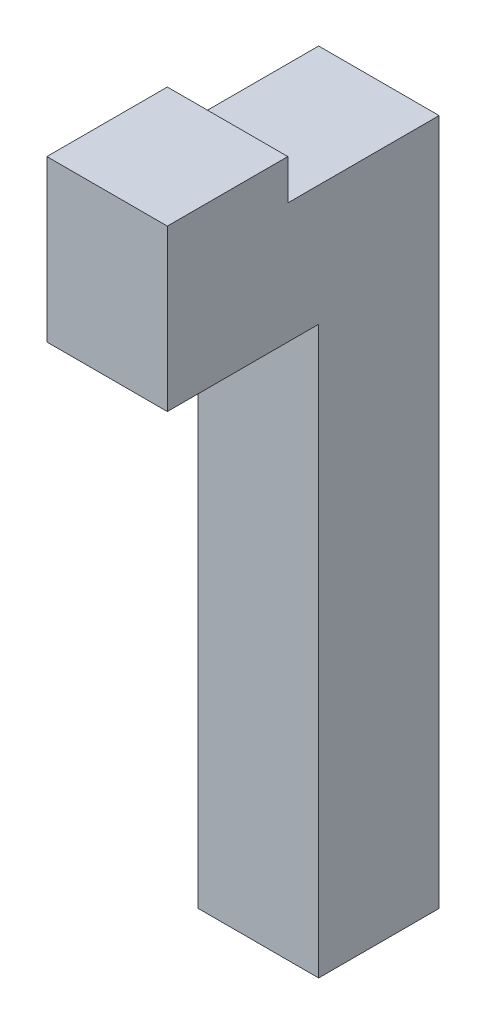
ISO-10303-21;
HEADER;
FILE_DESCRIPTION(('STEP AP214'),'2;1');
FILE_NAME('part.step','',(''),(''),'','','');
FILE_SCHEMA(('AUTOMOTIVE_DESIGN { 1 0 10303 214 1 1 1 1 }'));
ENDSEC;
DATA;
#1=APPLICATION_CONTEXT('core data for automotive mechanical design processes');
#2=APPLICATION_PROTOCOL_DEFINITION('international standard','automotive_design',2000,#1);
#3=PRODUCT_CONTEXT('',#1,'mechanical');
#4=PRODUCT('Part','Part','',(#3));
#5=PRODUCT_RELATED_PRODUCT_CATEGORY('part','',(#4));
#6=PRODUCT_DEFINITION_FORMATION('','',#4);
#7=PRODUCT_DEFINITION_CONTEXT('part definition',#1,'design');
#8=PRODUCT_DEFINITION('design','',#6,#7);
#9=PRODUCT_DEFINITION_SHAPE('','',#8);
#10=(LENGTH_UNIT() NAMED_UNIT(*) SI_UNIT(.MILLI.,.METRE.));
#11=(NAMED_UNIT(*) PLANE_ANGLE_UNIT() SI_UNIT($,.RADIAN.));
#12=(NAMED_UNIT(*) SI_UNIT($,.STERADIAN.) SOLID_ANGLE_UNIT());
#13=UNCERTAINTY_MEASURE_WITH_UNIT(LENGTH_MEASURE(1.E-05),#10,'distance_accuracy_value','');
#14=(GEOMETRIC_REPRESENTATION_CONTEXT(3) GLOBAL_UNCERTAINTY_ASSIGNED_CONTEXT((#13)) GLOBAL_UNIT_ASSIGNED_CONTEXT((#10,
#11,#12)) REPRESENTATION_CONTEXT('',''));
#15=CARTESIAN_POINT('',(0.,0.,0.));
#16=DIRECTION('',(0.,0.,1.));
#17=DIRECTION('',(1.,0.,0.));
#18=AXIS2_PLACEMENT_3D('',#15,#16,#17);
#19=CARTESIAN_POINT('',(-15.,171.,15.));
#20=DIRECTION('',(0.,0.,-1.));
#21=DIRECTION('',(-1.,0.,0.));
#22=AXIS2_PLACEMENT_3D('',#19,#20,#21);
#23=PLANE('',#22);
#24=DIRECTION('',(1.,0.,0.));
#25=VECTOR('',#24,1.);
#26=CARTESIAN_POINT('',(-15.,141.,15.));
#27=LINE('',#26,#25);
#28=CARTESIAN_POINT('',(-15.,141.,15.));
#29=VERTEX_POINT('',#28);
#30=CARTESIAN_POINT('',(15.,141.,15.));
#31=VERTEX_POINT('',#30);
#32=EDGE_CURVE('E62',#29,#31,#27,.T.);
#33=ORIENTED_EDGE('',*,*,#32,.F.);
#34=DIRECTION('',(0.,-1.,0.));
#35=VECTOR('',#34,1.);
#36=CARTESIAN_POINT('',(-15.,171.,15.));
#37=LINE('',#36,#35);
#38=CARTESIAN_POINT('',(-15.,0.,15.));
#39=VERTEX_POINT('',#38);
#40=EDGE_CURVE('E171',#29,#39,#37,.T.);
#41=ORIENTED_EDGE('',*,*,#40,.T.);
#42=DIRECTION('',(1.,0.,0.));
#43=VECTOR('',#42,1.);
#44=CARTESIAN_POINT('',(-15.,0.,15.));
#45=LINE('',#44,#43);
#46=CARTESIAN_POINT('',(15.,0.,15.));
#47=VERTEX_POINT('',#46);
#48=EDGE_CURVE('E157',#39,#47,#45,.T.);
#49=ORIENTED_EDGE('',*,*,#48,.T.);
#50=DIRECTION('',(0.,-1.,0.));
#51=VECTOR('',#50,1.);
#52=CARTESIAN_POINT('',(15.,171.,15.));
#53=LINE('',#52,#51);
#54=EDGE_CURVE('E161',#31,#47,#53,.T.);
#55=ORIENTED_EDGE('',*,*,#54,.F.);
#56=EDGE_LOOP('',(#33,#41,#49,#55));
#57=FACE_BOUND('',#56,.T.);
#58=ADVANCED_FACE('F39',(#57),#23,.F.);
#59=CARTESIAN_POINT('',(15.,171.,-15.));
#60=DIRECTION('',(-1.,0.,0.));
#61=DIRECTION('',(0.,0.,1.));
#62=AXIS2_PLACEMENT_3D('',#59,#60,#61);
#63=PLANE('',#62);
#64=DIRECTION('',(0.,0.,-1.));
#65=VECTOR('',#64,1.);
#66=CARTESIAN_POINT('',(15.,0.,-15.));
#67=LINE('',#66,#65);
#68=CARTESIAN_POINT('',(15.,0.,-15.));
#69=VERTEX_POINT('',#68);
#70=EDGE_CURVE('E151',#47,#69,#67,.T.);
#71=ORIENTED_EDGE('',*,*,#70,.T.);
#72=DIRECTION('',(0.,-1.,0.));
#73=VECTOR('',#72,1.);
#74=CARTESIAN_POINT('',(15.,171.,-15.));
#75=LINE('',#74,#73);
#76=CARTESIAN_POINT('',(15.,171.,-15.));
#77=VERTEX_POINT('',#76);
#78=EDGE_CURVE('E11',#77,#69,#75,.T.);
#79=ORIENTED_EDGE('',*,*,#78,.F.);
#80=DIRECTION('',(0.,0.,-1.));
#81=VECTOR('',#80,1.);
#82=CARTESIAN_POINT('',(15.,171.,-15.));
#83=LINE('',#82,#81);
#84=CARTESIAN_POINT('',(15.,171.,22.6839));
#85=VERTEX_POINT('',#84);
#86=EDGE_CURVE('E154',#85,#77,#83,.T.);
#87=ORIENTED_EDGE('',*,*,#86,.F.);
#88=DIRECTION('',(0.,-1.,0.));
#89=VECTOR('',#88,1.);
#90=CARTESIAN_POINT('',(15.,181.,22.6839));
#91=LINE('',#90,#89);
#92=CARTESIAN_POINT('',(15.,181.,22.6839));
#93=VERTEX_POINT('',#92);
#94=EDGE_CURVE('E137',#93,#85,#91,.T.);
#95=ORIENTED_EDGE('',*,*,#94,.F.);
#96=DIRECTION('',(0.,0.,-1.));
#97=VECTOR('',#96,1.);
#98=CARTESIAN_POINT('',(15.,181.,52.6839));
#99=LINE('',#98,#97);
#100=CARTESIAN_POINT('',(15.,181.,52.6839));
#101=VERTEX_POINT('',#100);
#102=EDGE_CURVE('E124',#101,#93,#99,.T.);
#103=ORIENTED_EDGE('',*,*,#102,.F.);
#104=DIRECTION('',(0.,1.,0.));
#105=VECTOR('',#104,1.);
#106=CARTESIAN_POINT('',(15.,171.,52.6839));
#107=LINE('',#106,#105);
#108=CARTESIAN_POINT('',(15.,141.,52.6839));
#109=VERTEX_POINT('',#108);
#110=EDGE_CURVE('E121',#109,#101,#107,.T.);
#111=ORIENTED_EDGE('',*,*,#110,.F.);
#112=DIRECTION('',(0.,0.,-1.));
#113=VECTOR('',#112,1.);
#114=CARTESIAN_POINT('',(15.,141.,52.6839));
#115=LINE('',#114,#113);
#116=EDGE_CURVE('E142',#109,#31,#115,.T.);
#117=ORIENTED_EDGE('',*,*,#116,.T.);
#118=ORIENTED_EDGE('',*,*,#54,.T.);
#119=EDGE_LOOP('',(#71,#79,#87,#95,#103,#111,#117,#118));
#120=FACE_BOUND('',#119,.T.);
#121=ADVANCED_FACE('F41',(#120),#63,.F.);
#122=CARTESIAN_POINT('',(-15.,171.,-15.));
#123=DIRECTION('',(0.,0.,1.));
#124=DIRECTION('',(1.,0.,0.));
#125=AXIS2_PLACEMENT_3D('',#122,#123,#124);
#126=PLANE('',#125);
#127=DIRECTION('',(-1.,0.,0.));
#128=VECTOR('',#127,1.);
#129=CARTESIAN_POINT('',(-15.,0.,-15.));
#130=LINE('',#129,#128);
#131=CARTESIAN_POINT('',(-15.,0.,-15.));
#132=VERTEX_POINT('',#131);
#133=EDGE_CURVE('E164',#69,#132,#130,.T.);
#134=ORIENTED_EDGE('',*,*,#133,.T.);
#135=DIRECTION('',(0.,-1.,0.));
#136=VECTOR('',#135,1.);
#137=CARTESIAN_POINT('',(-15.,171.,-15.));
#138=LINE('',#137,#136);
#139=CARTESIAN_POINT('',(-15.,171.,-15.));
#140=VERTEX_POINT('',#139);
#141=EDGE_CURVE('E47',#140,#132,#138,.T.);
#142=ORIENTED_EDGE('',*,*,#141,.F.);
#143=DIRECTION('',(-1.,0.,0.));
#144=VECTOR('',#143,1.);
#145=CARTESIAN_POINT('',(-15.,171.,-15.));
#146=LINE('',#145,#144);
#147=EDGE_CURVE('E156',#77,#140,#146,.T.);
#148=ORIENTED_EDGE('',*,*,#147,.F.);
#149=ORIENTED_EDGE('',*,*,#78,.T.);
#150=EDGE_LOOP('',(#134,#142,#148,#149));
#151=FACE_BOUND('',#150,.T.);
#152=ADVANCED_FACE('F205',(#151),#126,.F.);
#153=CARTESIAN_POINT('',(-15.,171.,-15.));
#154=DIRECTION('',(1.,0.,0.));
#155=DIRECTION('',(0.,0.,-1.));
#156=AXIS2_PLACEMENT_3D('',#153,#154,#155);
#157=PLANE('',#156);
#158=DIRECTION('',(0.,0.,1.));
#159=VECTOR('',#158,1.);
#160=CARTESIAN_POINT('',(-15.,0.,-15.));
#161=LINE('',#160,#159);
#162=EDGE_CURVE('E166',#132,#39,#161,.T.);
#163=ORIENTED_EDGE('',*,*,#162,.T.);
#164=ORIENTED_EDGE('',*,*,#40,.F.);
#165=DIRECTION('',(0.,0.,-1.));
#166=VECTOR('',#165,1.);
#167=CARTESIAN_POINT('',(-15.,141.,52.6839));
#168=LINE('',#167,#166);
#169=CARTESIAN_POINT('',(-15.,141.,52.6839));
#170=VERTEX_POINT('',#169);
#171=EDGE_CURVE('E113',#170,#29,#168,.T.);
#172=ORIENTED_EDGE('',*,*,#171,.F.);
#173=DIRECTION('',(0.,-1.,0.));
#174=VECTOR('',#173,1.);
#175=CARTESIAN_POINT('',(-15.,171.,52.6839));
#176=LINE('',#175,#174);
#177=CARTESIAN_POINT('',(-15.,181.,52.6839));
#178=VERTEX_POINT('',#177);
#179=EDGE_CURVE('E105',#178,#170,#176,.T.);
#180=ORIENTED_EDGE('',*,*,#179,.F.);
#181=DIRECTION('',(0.,0.,1.));
#182=VECTOR('',#181,1.);
#183=CARTESIAN_POINT('',(-15.,181.,52.6839));
#184=LINE('',#183,#182);
#185=CARTESIAN_POINT('',(-15.,181.,22.6839));
#186=VERTEX_POINT('',#185);
#187=EDGE_CURVE('E111',#186,#178,#184,.T.);
#188=ORIENTED_EDGE('',*,*,#187,.F.);
#189=DIRECTION('',(0.,-1.,0.));
#190=VECTOR('',#189,1.);
#191=CARTESIAN_POINT('',(-15.,181.,22.6839));
#192=LINE('',#191,#190);
#193=CARTESIAN_POINT('',(-15.,171.,22.6839));
#194=VERTEX_POINT('',#193);
#195=EDGE_CURVE('E134',#186,#194,#192,.T.);
#196=ORIENTED_EDGE('',*,*,#195,.T.);
#197=DIRECTION('',(0.,0.,1.));
#198=VECTOR('',#197,1.);
#199=CARTESIAN_POINT('',(-15.,171.,-15.));
#200=LINE('',#199,#198);
#201=EDGE_CURVE('E159',#140,#194,#200,.T.);
#202=ORIENTED_EDGE('',*,*,#201,.F.);
#203=ORIENTED_EDGE('',*,*,#141,.T.);
#204=EDGE_LOOP('',(#163,#164,#172,#180,#188,#196,#202,#203));
#205=FACE_BOUND('',#204,.T.);
#206=ADVANCED_FACE('F108',(#205),#157,.F.);
#207=CARTESIAN_POINT('',(0.,171.,0.));
#208=DIRECTION('',(0.,1.,0.));
#209=DIRECTION('',(0.,0.,1.));
#210=AXIS2_PLACEMENT_3D('',#207,#208,#209);
#211=PLANE('',#210);
#212=DIRECTION('',(-1.,0.,0.));
#213=VECTOR('',#212,1.);
#214=CARTESIAN_POINT('',(-15.,171.,22.6839));
#215=LINE('',#214,#213);
#216=EDGE_CURVE('E54',#85,#194,#215,.T.);
#217=ORIENTED_EDGE('',*,*,#216,.F.);
#218=ORIENTED_EDGE('',*,*,#86,.T.);
#219=ORIENTED_EDGE('',*,*,#147,.T.);
#220=ORIENTED_EDGE('',*,*,#201,.T.);
#221=EDGE_LOOP('',(#217,#218,#219,#220));
#222=FACE_BOUND('',#221,.T.);
#223=ADVANCED_FACE('F210',(#222),#211,.T.);
#224=CARTESIAN_POINT('',(0.,0.,0.));
#225=DIRECTION('',(0.,1.,0.));
#226=DIRECTION('',(0.,0.,1.));
#227=AXIS2_PLACEMENT_3D('',#224,#225,#226);
#228=PLANE('',#227);
#229=CARTESIAN_POINT('',(0.,0.,0.));
#230=DIRECTION('',(0.,-1.,0.));
#231=DIRECTION('',(0.,0.,-1.));
#232=AXIS2_PLACEMENT_3D('',#229,#230,#231);
#233=CIRCLE('',#232,10.);
#234=CARTESIAN_POINT('',(0.,0.,-10.));
#235=VERTEX_POINT('',#234);
#236=EDGE_CURVE('E147',#235,#235,#233,.T.);
#237=ORIENTED_EDGE('',*,*,#236,.F.);
#238=EDGE_LOOP('',(#237));
#239=FACE_BOUND('',#238,.T.);
#240=ORIENTED_EDGE('',*,*,#70,.F.);
#241=ORIENTED_EDGE('',*,*,#48,.F.);
#242=ORIENTED_EDGE('',*,*,#162,.F.);
#243=ORIENTED_EDGE('',*,*,#133,.F.);
#244=EDGE_LOOP('',(#240,#241,#242,#243));
#245=FACE_BOUND('',#244,.T.);
#246=ADVANCED_FACE('F181',(#239,#245),#228,.F.);
#247=CARTESIAN_POINT('',(0.,10.,0.));
#248=DIRECTION('',(0.,-1.,0.));
#249=DIRECTION('',(0.,0.,-1.));
#250=AXIS2_PLACEMENT_3D('',#247,#248,#249);
#251=CYLINDRICAL_SURFACE('',#250,10.);
#252=CARTESIAN_POINT('',(0.,10.,0.));
#253=DIRECTION('',(0.,-1.,0.));
#254=DIRECTION('',(0.,0.,-1.));
#255=AXIS2_PLACEMENT_3D('',#252,#253,#254);
#256=CIRCLE('',#255,10.);
#257=CARTESIAN_POINT('',(0.,10.,-10.));
#258=VERTEX_POINT('',#257);
#259=EDGE_CURVE('E148',#258,#258,#256,.T.);
#260=ORIENTED_EDGE('',*,*,#259,.F.);
#261=EDGE_LOOP('',(#260));
#262=FACE_BOUND('',#261,.T.);
#263=ORIENTED_EDGE('',*,*,#236,.T.);
#264=EDGE_LOOP('',(#263));
#265=FACE_BOUND('',#264,.T.);
#266=ADVANCED_FACE('F219',(#262,#265),#251,.F.);
#267=CARTESIAN_POINT('',(0.,10.,0.));
#268=DIRECTION('',(0.,-1.,0.));
#269=DIRECTION('',(0.,0.,-1.));
#270=AXIS2_PLACEMENT_3D('',#267,#268,#269);
#271=PLANE('',#270);
#272=ORIENTED_EDGE('',*,*,#259,.T.);
#273=EDGE_LOOP('',(#272));
#274=FACE_BOUND('',#273,.T.);
#275=ADVANCED_FACE('F224',(#274),#271,.T.);
#276=CARTESIAN_POINT('',(-15.,141.,52.6839));
#277=DIRECTION('',(0.,1.,0.));
#278=DIRECTION('',(0.,0.,1.));
#279=AXIS2_PLACEMENT_3D('',#276,#277,#278);
#280=PLANE('',#279);
#281=ORIENTED_EDGE('',*,*,#32,.T.);
#282=ORIENTED_EDGE('',*,*,#116,.F.);
#283=DIRECTION('',(1.,0.,0.));
#284=VECTOR('',#283,1.);
#285=CARTESIAN_POINT('',(-15.,141.,52.6839));
#286=LINE('',#285,#284);
#287=EDGE_CURVE('E115',#170,#109,#286,.T.);
#288=ORIENTED_EDGE('',*,*,#287,.F.);
#289=ORIENTED_EDGE('',*,*,#171,.T.);
#290=EDGE_LOOP('',(#281,#282,#288,#289));
#291=FACE_BOUND('',#290,.T.);
#292=ADVANCED_FACE('F183',(#291),#280,.F.);
#293=CARTESIAN_POINT('',(0.,0.,52.6839));
#294=DIRECTION('',(0.,0.,1.));
#295=DIRECTION('',(1.,0.,0.));
#296=AXIS2_PLACEMENT_3D('',#293,#294,#295);
#297=PLANE('',#296);
#298=ORIENTED_EDGE('',*,*,#179,.T.);
#299=ORIENTED_EDGE('',*,*,#287,.T.);
#300=ORIENTED_EDGE('',*,*,#110,.T.);
#301=DIRECTION('',(1.,0.,0.));
#302=VECTOR('',#301,1.);
#303=CARTESIAN_POINT('',(-15.,181.,52.6839));
#304=LINE('',#303,#302);
#305=EDGE_CURVE('E118',#178,#101,#304,.T.);
#306=ORIENTED_EDGE('',*,*,#305,.F.);
#307=EDGE_LOOP('',(#298,#299,#300,#306));
#308=FACE_BOUND('',#307,.T.);
#309=ADVANCED_FACE('F119',(#308),#297,.T.);
#310=CARTESIAN_POINT('',(-15.,181.,22.6839));
#311=DIRECTION('',(0.,0.,1.));
#312=DIRECTION('',(1.,0.,0.));
#313=AXIS2_PLACEMENT_3D('',#310,#311,#312);
#314=PLANE('',#313);
#315=ORIENTED_EDGE('',*,*,#216,.T.);
#316=ORIENTED_EDGE('',*,*,#195,.F.);
#317=DIRECTION('',(-1.,0.,0.));
#318=VECTOR('',#317,1.);
#319=CARTESIAN_POINT('',(-15.,181.,22.6839));
#320=LINE('',#319,#318);
#321=EDGE_CURVE('E128',#93,#186,#320,.T.);
#322=ORIENTED_EDGE('',*,*,#321,.F.);
#323=ORIENTED_EDGE('',*,*,#94,.T.);
#324=EDGE_LOOP('',(#315,#316,#322,#323));
#325=FACE_BOUND('',#324,.T.);
#326=ADVANCED_FACE('F189',(#325),#314,.F.);
#327=CARTESIAN_POINT('',(0.,181.,0.));
#328=DIRECTION('',(0.,-1.,0.));
#329=DIRECTION('',(0.,0.,-1.));
#330=AXIS2_PLACEMENT_3D('',#327,#328,#329);
#331=PLANE('',#330);
#332=ORIENTED_EDGE('',*,*,#187,.T.);
#333=ORIENTED_EDGE('',*,*,#305,.T.);
#334=ORIENTED_EDGE('',*,*,#102,.T.);
#335=ORIENTED_EDGE('',*,*,#321,.T.);
#336=EDGE_LOOP('',(#332,#333,#334,#335));
#337=FACE_BOUND('',#336,.T.);
#338=ADVANCED_FACE('F126',(#337),#331,.F.);
#339=CLOSED_SHELL('',(#58,#121,#152,#206,#223,#246,#266,#275,#292,#309,#326,#338));
#340=MANIFOLD_SOLID_BREP('B2',#339);
#341=ADVANCED_BREP_SHAPE_REPRESENTATION('',(#18,#340),#14);
#342=SHAPE_DEFINITION_REPRESENTATION(#9,#341);
ENDSEC;
END-ISO-10303-21;
